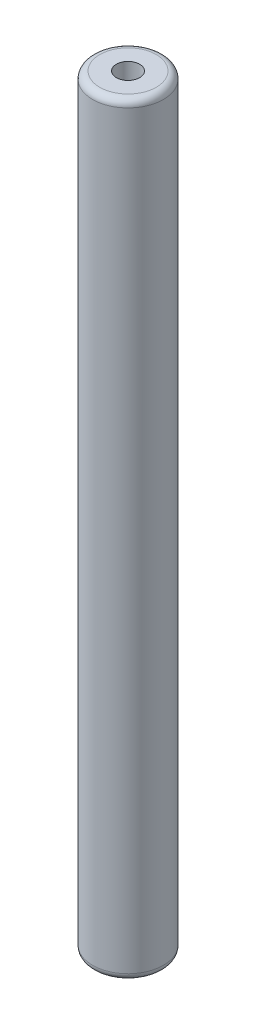
ISO-10303-21;
HEADER;
FILE_DESCRIPTION(('STEP AP214'),'2;1');
FILE_NAME('part.step','',(''),(''),'','','');
FILE_SCHEMA(('AUTOMOTIVE_DESIGN { 1 0 10303 214 1 1 1 1 }'));
ENDSEC;
DATA;
#1=APPLICATION_CONTEXT('core data for automotive mechanical design processes');
#2=APPLICATION_PROTOCOL_DEFINITION('international standard','automotive_design',2000,#1);
#3=PRODUCT_CONTEXT('',#1,'mechanical');
#4=PRODUCT('Part','Part','',(#3));
#5=PRODUCT_RELATED_PRODUCT_CATEGORY('part','',(#4));
#6=PRODUCT_DEFINITION_FORMATION('','',#4);
#7=PRODUCT_DEFINITION_CONTEXT('part definition',#1,'design');
#8=PRODUCT_DEFINITION('design','',#6,#7);
#9=PRODUCT_DEFINITION_SHAPE('','',#8);
#10=(LENGTH_UNIT() NAMED_UNIT(*) SI_UNIT(.MILLI.,.METRE.));
#11=(NAMED_UNIT(*) PLANE_ANGLE_UNIT() SI_UNIT($,.RADIAN.));
#12=(NAMED_UNIT(*) SI_UNIT($,.STERADIAN.) SOLID_ANGLE_UNIT());
#13=UNCERTAINTY_MEASURE_WITH_UNIT(LENGTH_MEASURE(1.E-05),#10,'distance_accuracy_value','');
#14=(GEOMETRIC_REPRESENTATION_CONTEXT(3) GLOBAL_UNCERTAINTY_ASSIGNED_CONTEXT((#13)) GLOBAL_UNIT_ASSIGNED_CONTEXT((#10,
#11,#12)) REPRESENTATION_CONTEXT('',''));
#15=CARTESIAN_POINT('',(0.,0.,0.));
#16=DIRECTION('',(0.,0.,1.));
#17=DIRECTION('',(1.,0.,0.));
#18=AXIS2_PLACEMENT_3D('',#15,#16,#17);
#19=CARTESIAN_POINT('',(0.,-27.,0.));
#20=DIRECTION('',(0.,-1.,0.));
#21=DIRECTION('',(0.,0.,1.));
#22=AXIS2_PLACEMENT_3D('',#19,#20,#21);
#23=PLANE('',#22);
#24=CARTESIAN_POINT('',(0.,-27.,0.));
#25=DIRECTION('',(0.,-1.,0.));
#26=DIRECTION('',(0.,0.,-1.));
#27=AXIS2_PLACEMENT_3D('',#24,#25,#26);
#28=CIRCLE('',#27,2.);
#29=CARTESIAN_POINT('',(0.,-27.,-2.));
#30=VERTEX_POINT('',#29);
#31=EDGE_CURVE('E10',#30,#30,#28,.T.);
#32=ORIENTED_EDGE('',*,*,#31,.T.);
#33=EDGE_LOOP('',(#32));
#34=FACE_BOUND('',#33,.T.);
#35=CARTESIAN_POINT('',(0.,-27.,0.));
#36=DIRECTION('',(0.,1.,0.));
#37=DIRECTION('',(0.,0.,1.));
#38=AXIS2_PLACEMENT_3D('',#35,#36,#37);
#39=CIRCLE('',#38,0.825);
#40=CARTESIAN_POINT('',(0.,-27.,0.825));
#41=VERTEX_POINT('',#40);
#42=EDGE_CURVE('E67',#41,#41,#39,.T.);
#43=ORIENTED_EDGE('',*,*,#42,.T.);
#44=EDGE_LOOP('',(#43));
#45=FACE_BOUND('',#44,.T.);
#46=ADVANCED_FACE('F32',(#34,#45),#23,.T.);
#47=CARTESIAN_POINT('',(0.,27.,0.));
#48=DIRECTION('',(0.,-1.,0.));
#49=DIRECTION('',(0.,0.,-1.));
#50=AXIS2_PLACEMENT_3D('',#47,#48,#49);
#51=CYLINDRICAL_SURFACE('',#50,2.5);
#52=CARTESIAN_POINT('',(0.,-26.5,0.));
#53=DIRECTION('',(0.,-1.,0.));
#54=DIRECTION('',(0.,0.,-1.));
#55=AXIS2_PLACEMENT_3D('',#52,#53,#54);
#56=CIRCLE('',#55,2.5);
#57=CARTESIAN_POINT('',(0.,-26.5,-2.5));
#58=VERTEX_POINT('',#57);
#59=EDGE_CURVE('E40',#58,#58,#56,.F.);
#60=ORIENTED_EDGE('',*,*,#59,.T.);
#61=EDGE_LOOP('',(#60));
#62=FACE_BOUND('',#61,.T.);
#63=CARTESIAN_POINT('',(0.,26.5,0.));
#64=DIRECTION('',(0.,1.,0.));
#65=DIRECTION('',(0.,0.,1.));
#66=AXIS2_PLACEMENT_3D('',#63,#64,#65);
#67=CIRCLE('',#66,2.5);
#68=CARTESIAN_POINT('',(0.,26.5,2.5));
#69=VERTEX_POINT('',#68);
#70=EDGE_CURVE('E47',#69,#69,#67,.F.);
#71=ORIENTED_EDGE('',*,*,#70,.T.);
#72=EDGE_LOOP('',(#71));
#73=FACE_BOUND('',#72,.T.);
#74=ADVANCED_FACE('F89',(#62,#73),#51,.T.);
#75=CARTESIAN_POINT('',(0.,27.,0.));
#76=DIRECTION('',(0.,1.,0.));
#77=DIRECTION('',(0.,0.,1.));
#78=AXIS2_PLACEMENT_3D('',#75,#76,#77);
#79=PLANE('',#78);
#80=CARTESIAN_POINT('',(0.,27.,0.));
#81=DIRECTION('',(0.,1.,0.));
#82=DIRECTION('',(0.,0.,1.));
#83=AXIS2_PLACEMENT_3D('',#80,#81,#82);
#84=CIRCLE('',#83,2.);
#85=CARTESIAN_POINT('',(0.,27.,2.));
#86=VERTEX_POINT('',#85);
#87=EDGE_CURVE('E53',#86,#86,#84,.T.);
#88=ORIENTED_EDGE('',*,*,#87,.T.);
#89=EDGE_LOOP('',(#88));
#90=FACE_BOUND('',#89,.T.);
#91=CARTESIAN_POINT('',(0.,27.,0.));
#92=DIRECTION('',(0.,1.,0.));
#93=DIRECTION('',(0.,0.,1.));
#94=AXIS2_PLACEMENT_3D('',#91,#92,#93);
#95=CIRCLE('',#94,0.825);
#96=CARTESIAN_POINT('',(0.,27.,0.825));
#97=VERTEX_POINT('',#96);
#98=EDGE_CURVE('E60',#97,#97,#95,.T.);
#99=ORIENTED_EDGE('',*,*,#98,.F.);
#100=EDGE_LOOP('',(#99));
#101=FACE_BOUND('',#100,.T.);
#102=ADVANCED_FACE('F94',(#90,#101),#79,.T.);
#103=CARTESIAN_POINT('',(0.,22.,0.));
#104=DIRECTION('',(0.,1.,0.));
#105=DIRECTION('',(0.,0.,1.));
#106=AXIS2_PLACEMENT_3D('',#103,#104,#105);
#107=CYLINDRICAL_SURFACE('',#106,0.825);
#108=CARTESIAN_POINT('',(0.,22.,0.));
#109=DIRECTION('',(0.,1.,0.));
#110=DIRECTION('',(0.,0.,1.));
#111=AXIS2_PLACEMENT_3D('',#108,#109,#110);
#112=CIRCLE('',#111,0.825);
#113=CARTESIAN_POINT('',(0.,22.,0.825));
#114=VERTEX_POINT('',#113);
#115=EDGE_CURVE('E59',#114,#114,#112,.T.);
#116=ORIENTED_EDGE('',*,*,#115,.F.);
#117=EDGE_LOOP('',(#116));
#118=FACE_BOUND('',#117,.T.);
#119=ORIENTED_EDGE('',*,*,#98,.T.);
#120=EDGE_LOOP('',(#119));
#121=FACE_BOUND('',#120,.T.);
#122=ADVANCED_FACE('F101',(#118,#121),#107,.F.);
#123=CARTESIAN_POINT('',(0.,22.,0.));
#124=DIRECTION('',(0.,1.,0.));
#125=DIRECTION('',(0.,0.,1.));
#126=AXIS2_PLACEMENT_3D('',#123,#124,#125);
#127=PLANE('',#126);
#128=ORIENTED_EDGE('',*,*,#115,.T.);
#129=EDGE_LOOP('',(#128));
#130=FACE_BOUND('',#129,.T.);
#131=ADVANCED_FACE('F98',(#130),#127,.T.);
#132=CARTESIAN_POINT('',(0.,26.5,0.));
#133=DIRECTION('',(0.,1.,0.));
#134=DIRECTION('',(0.,0.,1.));
#135=AXIS2_PLACEMENT_3D('',#132,#133,#134);
#136=TOROIDAL_SURFACE('',#135,2.,0.5);
#137=ORIENTED_EDGE('',*,*,#70,.F.);
#138=EDGE_LOOP('',(#137));
#139=FACE_BOUND('',#138,.T.);
#140=ORIENTED_EDGE('',*,*,#87,.F.);
#141=EDGE_LOOP('',(#140));
#142=FACE_BOUND('',#141,.T.);
#143=ADVANCED_FACE('F86',(#139,#142),#136,.T.);
#144=CARTESIAN_POINT('',(0.,-22.,0.));
#145=DIRECTION('',(0.,-1.,0.));
#146=DIRECTION('',(0.,0.,-1.));
#147=AXIS2_PLACEMENT_3D('',#144,#145,#146);
#148=CYLINDRICAL_SURFACE('',#147,0.825);
#149=CARTESIAN_POINT('',(0.,-22.,0.));
#150=DIRECTION('',(0.,1.,0.));
#151=DIRECTION('',(0.,0.,1.));
#152=AXIS2_PLACEMENT_3D('',#149,#150,#151);
#153=CIRCLE('',#152,0.825);
#154=CARTESIAN_POINT('',(0.,-22.,0.825));
#155=VERTEX_POINT('',#154);
#156=EDGE_CURVE('E64',#155,#155,#153,.T.);
#157=ORIENTED_EDGE('',*,*,#156,.T.);
#158=EDGE_LOOP('',(#157));
#159=FACE_BOUND('',#158,.T.);
#160=ORIENTED_EDGE('',*,*,#42,.F.);
#161=EDGE_LOOP('',(#160));
#162=FACE_BOUND('',#161,.T.);
#163=ADVANCED_FACE('F75',(#159,#162),#148,.F.);
#164=CARTESIAN_POINT('',(0.,-22.,0.));
#165=DIRECTION('',(0.,-1.,0.));
#166=DIRECTION('',(0.,0.,1.));
#167=AXIS2_PLACEMENT_3D('',#164,#165,#166);
#168=PLANE('',#167);
#169=ORIENTED_EDGE('',*,*,#156,.F.);
#170=EDGE_LOOP('',(#169));
#171=FACE_BOUND('',#170,.T.);
#172=ADVANCED_FACE('F78',(#171),#168,.T.);
#173=CARTESIAN_POINT('',(0.,-26.5,0.));
#174=DIRECTION('',(0.,-1.,0.));
#175=DIRECTION('',(0.,0.,-1.));
#176=AXIS2_PLACEMENT_3D('',#173,#174,#175);
#177=TOROIDAL_SURFACE('',#176,2.,0.5);
#178=ORIENTED_EDGE('',*,*,#31,.F.);
#179=EDGE_LOOP('',(#178));
#180=FACE_BOUND('',#179,.T.);
#181=ORIENTED_EDGE('',*,*,#59,.F.);
#182=EDGE_LOOP('',(#181));
#183=FACE_BOUND('',#182,.T.);
#184=ADVANCED_FACE('F34',(#180,#183),#177,.T.);
#185=CLOSED_SHELL('',(#46,#74,#102,#122,#131,#143,#163,#172,#184));
#186=MANIFOLD_SOLID_BREP('B2',#185);
#187=ADVANCED_BREP_SHAPE_REPRESENTATION('',(#18,#186),#14);
#188=SHAPE_DEFINITION_REPRESENTATION(#9,#187);
ENDSEC;
END-ISO-10303-21;
